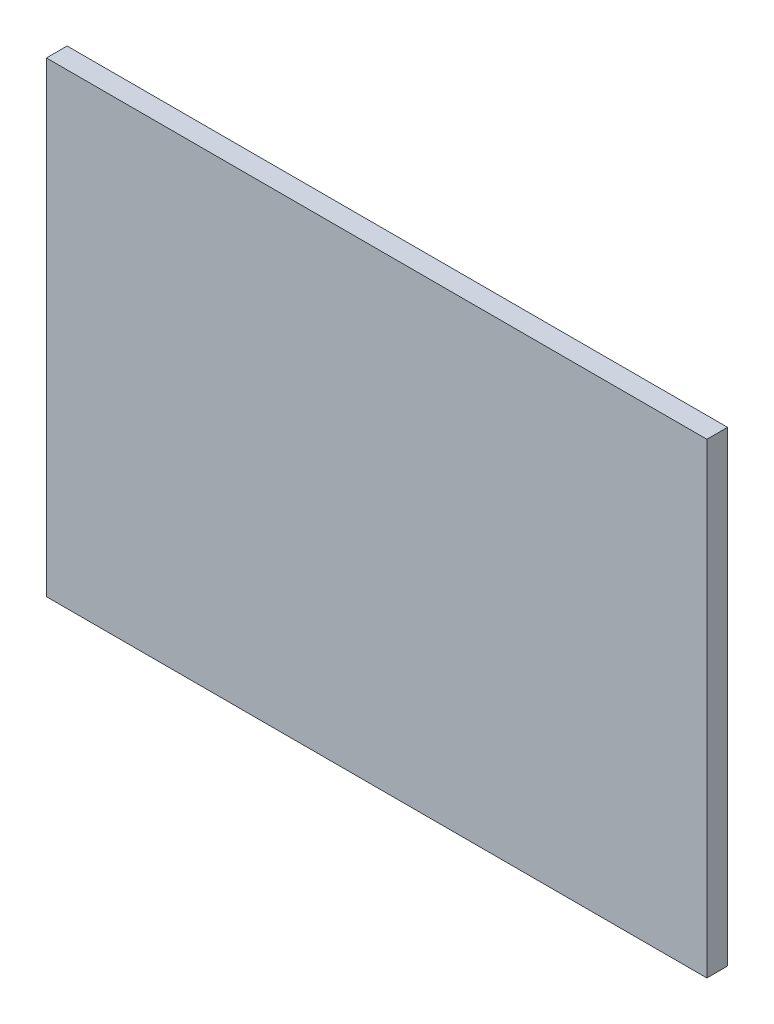
ISO-10303-21;
HEADER;
FILE_DESCRIPTION(('STEP AP214'),'2;1');
FILE_NAME('part.step','',(''),(''),'','','');
FILE_SCHEMA(('AUTOMOTIVE_DESIGN { 1 0 10303 214 1 1 1 1 }'));
ENDSEC;
DATA;
#1=APPLICATION_CONTEXT('core data for automotive mechanical design processes');
#2=APPLICATION_PROTOCOL_DEFINITION('international standard','automotive_design',2000,#1);
#3=PRODUCT_CONTEXT('',#1,'mechanical');
#4=PRODUCT('Part','Part','',(#3));
#5=PRODUCT_RELATED_PRODUCT_CATEGORY('part','',(#4));
#6=PRODUCT_DEFINITION_FORMATION('','',#4);
#7=PRODUCT_DEFINITION_CONTEXT('part definition',#1,'design');
#8=PRODUCT_DEFINITION('design','',#6,#7);
#9=PRODUCT_DEFINITION_SHAPE('','',#8);
#10=(LENGTH_UNIT() NAMED_UNIT(*) SI_UNIT(.MILLI.,.METRE.));
#11=(NAMED_UNIT(*) PLANE_ANGLE_UNIT() SI_UNIT($,.RADIAN.));
#12=(NAMED_UNIT(*) SI_UNIT($,.STERADIAN.) SOLID_ANGLE_UNIT());
#13=UNCERTAINTY_MEASURE_WITH_UNIT(LENGTH_MEASURE(1.E-05),#10,'distance_accuracy_value','');
#14=(GEOMETRIC_REPRESENTATION_CONTEXT(3) GLOBAL_UNCERTAINTY_ASSIGNED_CONTEXT((#13)) GLOBAL_UNIT_ASSIGNED_CONTEXT((#10,
#11,#12)) REPRESENTATION_CONTEXT('',''));
#15=CARTESIAN_POINT('',(0.,0.,0.));
#16=DIRECTION('',(0.,0.,1.));
#17=DIRECTION('',(1.,0.,0.));
#18=AXIS2_PLACEMENT_3D('',#15,#16,#17);
#19=CARTESIAN_POINT('',(12.7635,9.017,0.80000094));
#20=DIRECTION('',(0.,0.,1.));
#21=DIRECTION('',(1.,0.,0.));
#22=AXIS2_PLACEMENT_3D('',#19,#20,#21);
#23=PLANE('',#22);
#24=DIRECTION('',(1.,0.,0.));
#25=VECTOR('',#24,1.);
#26=CARTESIAN_POINT('',(12.7635,-9.017,0.80000094));
#27=LINE('',#26,#25);
#28=CARTESIAN_POINT('',(12.7635,-9.017,0.80000094));
#29=VERTEX_POINT('',#28);
#30=CARTESIAN_POINT('',(-12.7635,-9.017,0.80000094));
#31=VERTEX_POINT('',#30);
#32=EDGE_CURVE('E53',#29,#31,#27,.F.);
#33=ORIENTED_EDGE('',*,*,#32,.F.);
#34=DIRECTION('',(0.,1.,0.));
#35=VECTOR('',#34,1.);
#36=CARTESIAN_POINT('',(12.7635,9.017,0.80000094));
#37=LINE('',#36,#35);
#38=CARTESIAN_POINT('',(12.7635,9.017,0.80000094));
#39=VERTEX_POINT('',#38);
#40=EDGE_CURVE('E68',#39,#29,#37,.F.);
#41=ORIENTED_EDGE('',*,*,#40,.F.);
#42=DIRECTION('',(1.,0.,0.));
#43=VECTOR('',#42,1.);
#44=CARTESIAN_POINT('',(-12.7635,9.017,0.80000094));
#45=LINE('',#44,#43);
#46=CARTESIAN_POINT('',(-12.7635,9.017,0.80000094));
#47=VERTEX_POINT('',#46);
#48=EDGE_CURVE('E20',#47,#39,#45,.T.);
#49=ORIENTED_EDGE('',*,*,#48,.F.);
#50=DIRECTION('',(0.,1.,0.));
#51=VECTOR('',#50,1.);
#52=CARTESIAN_POINT('',(-12.7635,-9.017,0.80000094));
#53=LINE('',#52,#51);
#54=EDGE_CURVE('E58',#31,#47,#53,.T.);
#55=ORIENTED_EDGE('',*,*,#54,.F.);
#56=EDGE_LOOP('',(#33,#41,#49,#55));
#57=FACE_BOUND('',#56,.T.);
#58=ADVANCED_FACE('F17',(#57),#23,.T.);
#59=CARTESIAN_POINT('',(-12.7635,9.017,0.));
#60=DIRECTION('',(0.,1.,0.));
#61=DIRECTION('',(0.,0.,1.));
#62=AXIS2_PLACEMENT_3D('',#59,#60,#61);
#63=PLANE('',#62);
#64=DIRECTION('',(0.,0.,-1.));
#65=VECTOR('',#64,1.);
#66=CARTESIAN_POINT('',(12.7635,9.017,0.));
#67=LINE('',#66,#65);
#68=CARTESIAN_POINT('',(12.7635,9.017,0.));
#69=VERTEX_POINT('',#68);
#70=EDGE_CURVE('E79',#69,#39,#67,.F.);
#71=ORIENTED_EDGE('',*,*,#70,.F.);
#72=DIRECTION('',(1.,0.,0.));
#73=VECTOR('',#72,1.);
#74=CARTESIAN_POINT('',(12.7635,9.017,0.));
#75=LINE('',#74,#73);
#76=CARTESIAN_POINT('',(-12.7635,9.017,0.));
#77=VERTEX_POINT('',#76);
#78=EDGE_CURVE('E74',#69,#77,#75,.F.);
#79=ORIENTED_EDGE('',*,*,#78,.T.);
#80=DIRECTION('',(0.,0.,1.));
#81=VECTOR('',#80,1.);
#82=CARTESIAN_POINT('',(-12.7635,9.017,0.));
#83=LINE('',#82,#81);
#84=EDGE_CURVE('E63',#47,#77,#83,.F.);
#85=ORIENTED_EDGE('',*,*,#84,.F.);
#86=ORIENTED_EDGE('',*,*,#48,.T.);
#87=EDGE_LOOP('',(#71,#79,#85,#86));
#88=FACE_BOUND('',#87,.T.);
#89=ADVANCED_FACE('F73',(#88),#63,.T.);
#90=CARTESIAN_POINT('',(-12.7635,-9.017,0.));
#91=DIRECTION('',(-1.,0.,0.));
#92=DIRECTION('',(0.,0.,1.));
#93=AXIS2_PLACEMENT_3D('',#90,#91,#92);
#94=PLANE('',#93);
#95=ORIENTED_EDGE('',*,*,#84,.T.);
#96=DIRECTION('',(0.,1.,0.));
#97=VECTOR('',#96,1.);
#98=CARTESIAN_POINT('',(-12.7635,9.017,0.));
#99=LINE('',#98,#97);
#100=CARTESIAN_POINT('',(-12.7635,-9.017,0.));
#101=VERTEX_POINT('',#100);
#102=EDGE_CURVE('E84',#77,#101,#99,.F.);
#103=ORIENTED_EDGE('',*,*,#102,.T.);
#104=DIRECTION('',(0.,0.,-1.));
#105=VECTOR('',#104,1.);
#106=CARTESIAN_POINT('',(-12.7635,-9.017,0.));
#107=LINE('',#106,#105);
#108=EDGE_CURVE('E65',#31,#101,#107,.T.);
#109=ORIENTED_EDGE('',*,*,#108,.F.);
#110=ORIENTED_EDGE('',*,*,#54,.T.);
#111=EDGE_LOOP('',(#95,#103,#109,#110));
#112=FACE_BOUND('',#111,.T.);
#113=ADVANCED_FACE('F60',(#112),#94,.T.);
#114=CARTESIAN_POINT('',(12.7635,-9.017,0.));
#115=DIRECTION('',(0.,-1.,0.));
#116=DIRECTION('',(0.,0.,-1.));
#117=AXIS2_PLACEMENT_3D('',#114,#115,#116);
#118=PLANE('',#117);
#119=ORIENTED_EDGE('',*,*,#108,.T.);
#120=DIRECTION('',(1.,0.,0.));
#121=VECTOR('',#120,1.);
#122=CARTESIAN_POINT('',(12.7635,-9.017,0.));
#123=LINE('',#122,#121);
#124=CARTESIAN_POINT('',(12.7635,-9.017,0.));
#125=VERTEX_POINT('',#124);
#126=EDGE_CURVE('E26',#101,#125,#123,.T.);
#127=ORIENTED_EDGE('',*,*,#126,.T.);
#128=DIRECTION('',(0.,0.,-1.));
#129=VECTOR('',#128,1.);
#130=CARTESIAN_POINT('',(12.7635,-9.017,0.));
#131=LINE('',#130,#129);
#132=EDGE_CURVE('E34',#29,#125,#131,.T.);
#133=ORIENTED_EDGE('',*,*,#132,.F.);
#134=ORIENTED_EDGE('',*,*,#32,.T.);
#135=EDGE_LOOP('',(#119,#127,#133,#134));
#136=FACE_BOUND('',#135,.T.);
#137=ADVANCED_FACE('F88',(#136),#118,.T.);
#138=CARTESIAN_POINT('',(12.7635,9.017,0.));
#139=DIRECTION('',(1.,0.,0.));
#140=DIRECTION('',(0.,0.,-1.));
#141=AXIS2_PLACEMENT_3D('',#138,#139,#140);
#142=PLANE('',#141);
#143=ORIENTED_EDGE('',*,*,#132,.T.);
#144=DIRECTION('',(0.,1.,0.));
#145=VECTOR('',#144,1.);
#146=CARTESIAN_POINT('',(12.7635,9.017,0.));
#147=LINE('',#146,#145);
#148=EDGE_CURVE('E11',#125,#69,#147,.T.);
#149=ORIENTED_EDGE('',*,*,#148,.T.);
#150=ORIENTED_EDGE('',*,*,#70,.T.);
#151=ORIENTED_EDGE('',*,*,#40,.T.);
#152=EDGE_LOOP('',(#143,#149,#150,#151));
#153=FACE_BOUND('',#152,.T.);
#154=ADVANCED_FACE('F91',(#153),#142,.T.);
#155=CARTESIAN_POINT('',(12.7635,9.017,0.));
#156=DIRECTION('',(0.,0.,1.));
#157=DIRECTION('',(1.,0.,0.));
#158=AXIS2_PLACEMENT_3D('',#155,#156,#157);
#159=PLANE('',#158);
#160=ORIENTED_EDGE('',*,*,#126,.F.);
#161=ORIENTED_EDGE('',*,*,#102,.F.);
#162=ORIENTED_EDGE('',*,*,#78,.F.);
#163=ORIENTED_EDGE('',*,*,#148,.F.);
#164=EDGE_LOOP('',(#160,#161,#162,#163));
#165=FACE_BOUND('',#164,.T.);
#166=ADVANCED_FACE('F90',(#165),#159,.F.);
#167=CLOSED_SHELL('',(#58,#89,#113,#137,#154,#166));
#168=MANIFOLD_SOLID_BREP('B1',#167);
#169=ADVANCED_BREP_SHAPE_REPRESENTATION('',(#18,#168),#14);
#170=SHAPE_DEFINITION_REPRESENTATION(#9,#169);
ENDSEC;
END-ISO-10303-21;
